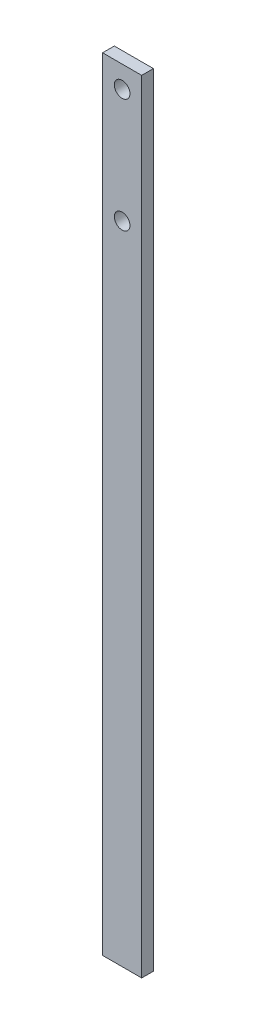
ISO-10303-21;
HEADER;
FILE_DESCRIPTION(('STEP AP214'),'2;1');
FILE_NAME('part.step','',(''),(''),'','','');
FILE_SCHEMA(('AUTOMOTIVE_DESIGN { 1 0 10303 214 1 1 1 1 }'));
ENDSEC;
DATA;
#1=APPLICATION_CONTEXT('core data for automotive mechanical design processes');
#2=APPLICATION_PROTOCOL_DEFINITION('international standard','automotive_design',2000,#1);
#3=PRODUCT_CONTEXT('',#1,'mechanical');
#4=PRODUCT('Part','Part','',(#3));
#5=PRODUCT_RELATED_PRODUCT_CATEGORY('part','',(#4));
#6=PRODUCT_DEFINITION_FORMATION('','',#4);
#7=PRODUCT_DEFINITION_CONTEXT('part definition',#1,'design');
#8=PRODUCT_DEFINITION('design','',#6,#7);
#9=PRODUCT_DEFINITION_SHAPE('','',#8);
#10=(LENGTH_UNIT() NAMED_UNIT(*) SI_UNIT(.MILLI.,.METRE.));
#11=(NAMED_UNIT(*) PLANE_ANGLE_UNIT() SI_UNIT($,.RADIAN.));
#12=(NAMED_UNIT(*) SI_UNIT($,.STERADIAN.) SOLID_ANGLE_UNIT());
#13=UNCERTAINTY_MEASURE_WITH_UNIT(LENGTH_MEASURE(1.E-05),#10,'distance_accuracy_value','');
#14=(GEOMETRIC_REPRESENTATION_CONTEXT(3) GLOBAL_UNCERTAINTY_ASSIGNED_CONTEXT((#13)) GLOBAL_UNIT_ASSIGNED_CONTEXT((#10,
#11,#12)) REPRESENTATION_CONTEXT('',''));
#15=CARTESIAN_POINT('',(0.,0.,0.));
#16=DIRECTION('',(0.,0.,1.));
#17=DIRECTION('',(1.,0.,0.));
#18=AXIS2_PLACEMENT_3D('',#15,#16,#17);
#19=CARTESIAN_POINT('',(5.00000000000002,100.,3.));
#20=DIRECTION('',(-1.,0.,0.));
#21=DIRECTION('',(0.,-1.,0.));
#22=AXIS2_PLACEMENT_3D('',#19,#20,#21);
#23=PLANE('',#22);
#24=DIRECTION('',(0.,1.,0.));
#25=VECTOR('',#24,1.);
#26=CARTESIAN_POINT('',(5.00000000000002,100.,0.));
#27=LINE('',#26,#25);
#28=CARTESIAN_POINT('',(5.00000000000004,-99.9999999999997,0.));
#29=VERTEX_POINT('',#28);
#30=CARTESIAN_POINT('',(5.00000000000002,100.,0.));
#31=VERTEX_POINT('',#30);
#32=EDGE_CURVE('E96',#29,#31,#27,.T.);
#33=ORIENTED_EDGE('',*,*,#32,.T.);
#34=DIRECTION('',(0.,0.,-1.));
#35=VECTOR('',#34,1.);
#36=CARTESIAN_POINT('',(5.00000000000002,100.,3.));
#37=LINE('',#36,#35);
#38=CARTESIAN_POINT('',(5.00000000000002,100.,3.));
#39=VERTEX_POINT('',#38);
#40=EDGE_CURVE('E11',#39,#31,#37,.T.);
#41=ORIENTED_EDGE('',*,*,#40,.F.);
#42=DIRECTION('',(0.,1.,0.));
#43=VECTOR('',#42,1.);
#44=CARTESIAN_POINT('',(5.00000000000002,100.,3.));
#45=LINE('',#44,#43);
#46=CARTESIAN_POINT('',(5.00000000000004,-99.9999999999997,3.));
#47=VERTEX_POINT('',#46);
#48=EDGE_CURVE('E84',#47,#39,#45,.T.);
#49=ORIENTED_EDGE('',*,*,#48,.F.);
#50=DIRECTION('',(0.,0.,-1.));
#51=VECTOR('',#50,1.);
#52=CARTESIAN_POINT('',(5.00000000000004,-99.9999999999997,3.));
#53=LINE('',#52,#51);
#54=EDGE_CURVE('E92',#47,#29,#53,.T.);
#55=ORIENTED_EDGE('',*,*,#54,.T.);
#56=EDGE_LOOP('',(#33,#41,#49,#55));
#57=FACE_BOUND('',#56,.T.);
#58=ADVANCED_FACE('F33',(#57),#23,.F.);
#59=CARTESIAN_POINT('',(-4.99999999999998,100.,3.));
#60=DIRECTION('',(0.,-1.,0.));
#61=DIRECTION('',(0.,0.,-1.));
#62=AXIS2_PLACEMENT_3D('',#59,#60,#61);
#63=PLANE('',#62);
#64=DIRECTION('',(-1.,0.,0.));
#65=VECTOR('',#64,1.);
#66=CARTESIAN_POINT('',(-4.99999999999998,100.,0.));
#67=LINE('',#66,#65);
#68=CARTESIAN_POINT('',(-4.99999999999998,100.,0.));
#69=VERTEX_POINT('',#68);
#70=EDGE_CURVE('E88',#31,#69,#67,.T.);
#71=ORIENTED_EDGE('',*,*,#70,.T.);
#72=DIRECTION('',(0.,0.,-1.));
#73=VECTOR('',#72,1.);
#74=CARTESIAN_POINT('',(-4.99999999999998,100.,3.));
#75=LINE('',#74,#73);
#76=CARTESIAN_POINT('',(-4.99999999999998,100.,3.));
#77=VERTEX_POINT('',#76);
#78=EDGE_CURVE('E41',#77,#69,#75,.T.);
#79=ORIENTED_EDGE('',*,*,#78,.F.);
#80=DIRECTION('',(-1.,0.,0.));
#81=VECTOR('',#80,1.);
#82=CARTESIAN_POINT('',(-4.99999999999998,100.,3.));
#83=LINE('',#82,#81);
#84=EDGE_CURVE('E79',#39,#77,#83,.T.);
#85=ORIENTED_EDGE('',*,*,#84,.F.);
#86=ORIENTED_EDGE('',*,*,#40,.T.);
#87=EDGE_LOOP('',(#71,#79,#85,#86));
#88=FACE_BOUND('',#87,.T.);
#89=ADVANCED_FACE('F87',(#88),#63,.F.);
#90=CARTESIAN_POINT('',(-4.99999999999998,100.,3.));
#91=DIRECTION('',(1.,0.,0.));
#92=DIRECTION('',(0.,1.,0.));
#93=AXIS2_PLACEMENT_3D('',#90,#91,#92);
#94=PLANE('',#93);
#95=DIRECTION('',(0.,-1.,0.));
#96=VECTOR('',#95,1.);
#97=CARTESIAN_POINT('',(-4.99999999999998,100.,0.));
#98=LINE('',#97,#96);
#99=CARTESIAN_POINT('',(-4.99999999999996,-99.9999999999997,0.));
#100=VERTEX_POINT('',#99);
#101=EDGE_CURVE('E66',#69,#100,#98,.T.);
#102=ORIENTED_EDGE('',*,*,#101,.T.);
#103=DIRECTION('',(0.,0.,-1.));
#104=VECTOR('',#103,1.);
#105=CARTESIAN_POINT('',(-4.99999999999996,-99.9999999999997,3.));
#106=LINE('',#105,#104);
#107=CARTESIAN_POINT('',(-4.99999999999996,-99.9999999999997,3.));
#108=VERTEX_POINT('',#107);
#109=EDGE_CURVE('E89',#108,#100,#106,.T.);
#110=ORIENTED_EDGE('',*,*,#109,.F.);
#111=DIRECTION('',(0.,-1.,0.));
#112=VECTOR('',#111,1.);
#113=CARTESIAN_POINT('',(-4.99999999999998,100.,3.));
#114=LINE('',#113,#112);
#115=EDGE_CURVE('E82',#77,#108,#114,.T.);
#116=ORIENTED_EDGE('',*,*,#115,.F.);
#117=ORIENTED_EDGE('',*,*,#78,.T.);
#118=EDGE_LOOP('',(#102,#110,#116,#117));
#119=FACE_BOUND('',#118,.T.);
#120=ADVANCED_FACE('F90',(#119),#94,.F.);
#121=CARTESIAN_POINT('',(-4.99999999999996,-99.9999999999997,3.));
#122=DIRECTION('',(0.,1.,0.));
#123=DIRECTION('',(0.,0.,1.));
#124=AXIS2_PLACEMENT_3D('',#121,#122,#123);
#125=PLANE('',#124);
#126=DIRECTION('',(1.,0.,0.));
#127=VECTOR('',#126,1.);
#128=CARTESIAN_POINT('',(-4.99999999999996,-99.9999999999997,0.));
#129=LINE('',#128,#127);
#130=EDGE_CURVE('E72',#100,#29,#129,.T.);
#131=ORIENTED_EDGE('',*,*,#130,.T.);
#132=ORIENTED_EDGE('',*,*,#54,.F.);
#133=DIRECTION('',(1.,0.,0.));
#134=VECTOR('',#133,1.);
#135=CARTESIAN_POINT('',(-4.99999999999996,-99.9999999999997,3.));
#136=LINE('',#135,#134);
#137=EDGE_CURVE('E49',#108,#47,#136,.T.);
#138=ORIENTED_EDGE('',*,*,#137,.F.);
#139=ORIENTED_EDGE('',*,*,#109,.T.);
#140=EDGE_LOOP('',(#131,#132,#138,#139));
#141=FACE_BOUND('',#140,.T.);
#142=ADVANCED_FACE('F104',(#141),#125,.F.);
#143=CARTESIAN_POINT('',(0.,0.,3.));
#144=DIRECTION('',(0.,0.,1.));
#145=DIRECTION('',(1.,0.,0.));
#146=AXIS2_PLACEMENT_3D('',#143,#144,#145);
#147=PLANE('',#146);
#148=CARTESIAN_POINT('',(0.,94.4021937750108,3.));
#149=DIRECTION('',(0.,0.,1.));
#150=DIRECTION('',(1.,0.,0.));
#151=AXIS2_PLACEMENT_3D('',#148,#149,#150);
#152=CIRCLE('',#151,2.);
#153=CARTESIAN_POINT('',(2.,94.4021937750108,3.));
#154=VERTEX_POINT('',#153);
#155=EDGE_CURVE('E116',#154,#154,#152,.T.);
#156=ORIENTED_EDGE('',*,*,#155,.F.);
#157=EDGE_LOOP('',(#156));
#158=FACE_BOUND('',#157,.T.);
#159=CARTESIAN_POINT('',(0.,65.2062343863378,3.));
#160=DIRECTION('',(0.,0.,1.));
#161=DIRECTION('',(1.,0.,0.));
#162=AXIS2_PLACEMENT_3D('',#159,#160,#161);
#163=CIRCLE('',#162,2.);
#164=CARTESIAN_POINT('',(2.,65.2062343863378,3.));
#165=VERTEX_POINT('',#164);
#166=EDGE_CURVE('E110',#165,#165,#163,.T.);
#167=ORIENTED_EDGE('',*,*,#166,.F.);
#168=EDGE_LOOP('',(#167));
#169=FACE_BOUND('',#168,.T.);
#170=ORIENTED_EDGE('',*,*,#48,.T.);
#171=ORIENTED_EDGE('',*,*,#84,.T.);
#172=ORIENTED_EDGE('',*,*,#115,.T.);
#173=ORIENTED_EDGE('',*,*,#137,.T.);
#174=EDGE_LOOP('',(#170,#171,#172,#173));
#175=FACE_BOUND('',#174,.T.);
#176=ADVANCED_FACE('F80',(#158,#169,#175),#147,.T.);
#177=CARTESIAN_POINT('',(0.,0.,0.));
#178=DIRECTION('',(0.,0.,1.));
#179=DIRECTION('',(1.,0.,0.));
#180=AXIS2_PLACEMENT_3D('',#177,#178,#179);
#181=PLANE('',#180);
#182=CARTESIAN_POINT('',(0.,94.4021937750108,0.));
#183=DIRECTION('',(0.,0.,1.));
#184=DIRECTION('',(1.,0.,0.));
#185=AXIS2_PLACEMENT_3D('',#182,#183,#184);
#186=CIRCLE('',#185,2.);
#187=CARTESIAN_POINT('',(2.,94.4021937750108,0.));
#188=VERTEX_POINT('',#187);
#189=EDGE_CURVE('E99',#188,#188,#186,.T.);
#190=ORIENTED_EDGE('',*,*,#189,.T.);
#191=EDGE_LOOP('',(#190));
#192=FACE_BOUND('',#191,.T.);
#193=CARTESIAN_POINT('',(0.,65.2062343863378,0.));
#194=DIRECTION('',(0.,0.,1.));
#195=DIRECTION('',(1.,0.,0.));
#196=AXIS2_PLACEMENT_3D('',#193,#194,#195);
#197=CIRCLE('',#196,2.);
#198=CARTESIAN_POINT('',(2.,65.2062343863378,0.));
#199=VERTEX_POINT('',#198);
#200=EDGE_CURVE('E113',#199,#199,#197,.T.);
#201=ORIENTED_EDGE('',*,*,#200,.T.);
#202=EDGE_LOOP('',(#201));
#203=FACE_BOUND('',#202,.T.);
#204=ORIENTED_EDGE('',*,*,#32,.F.);
#205=ORIENTED_EDGE('',*,*,#130,.F.);
#206=ORIENTED_EDGE('',*,*,#101,.F.);
#207=ORIENTED_EDGE('',*,*,#70,.F.);
#208=EDGE_LOOP('',(#204,#205,#206,#207));
#209=FACE_BOUND('',#208,.T.);
#210=ADVANCED_FACE('F107',(#192,#203,#209),#181,.F.);
#211=CARTESIAN_POINT('',(0.,65.2062343863378,0.));
#212=DIRECTION('',(0.,0.,1.));
#213=DIRECTION('',(1.,0.,0.));
#214=AXIS2_PLACEMENT_3D('',#211,#212,#213);
#215=CYLINDRICAL_SURFACE('',#214,2.);
#216=ORIENTED_EDGE('',*,*,#200,.F.);
#217=EDGE_LOOP('',(#216));
#218=FACE_BOUND('',#217,.T.);
#219=ORIENTED_EDGE('',*,*,#166,.T.);
#220=EDGE_LOOP('',(#219));
#221=FACE_BOUND('',#220,.T.);
#222=ADVANCED_FACE('F127',(#218,#221),#215,.F.);
#223=CARTESIAN_POINT('',(0.,94.4021937750108,0.));
#224=DIRECTION('',(0.,0.,1.));
#225=DIRECTION('',(1.,0.,0.));
#226=AXIS2_PLACEMENT_3D('',#223,#224,#225);
#227=CYLINDRICAL_SURFACE('',#226,2.);
#228=ORIENTED_EDGE('',*,*,#189,.F.);
#229=EDGE_LOOP('',(#228));
#230=FACE_BOUND('',#229,.T.);
#231=ORIENTED_EDGE('',*,*,#155,.T.);
#232=EDGE_LOOP('',(#231));
#233=FACE_BOUND('',#232,.T.);
#234=ADVANCED_FACE('F124',(#230,#233),#227,.F.);
#235=CLOSED_SHELL('',(#58,#89,#120,#142,#176,#210,#222,#234));
#236=MANIFOLD_SOLID_BREP('B2',#235);
#237=ADVANCED_BREP_SHAPE_REPRESENTATION('',(#18,#236),#14);
#238=SHAPE_DEFINITION_REPRESENTATION(#9,#237);
ENDSEC;
END-ISO-10303-21;
